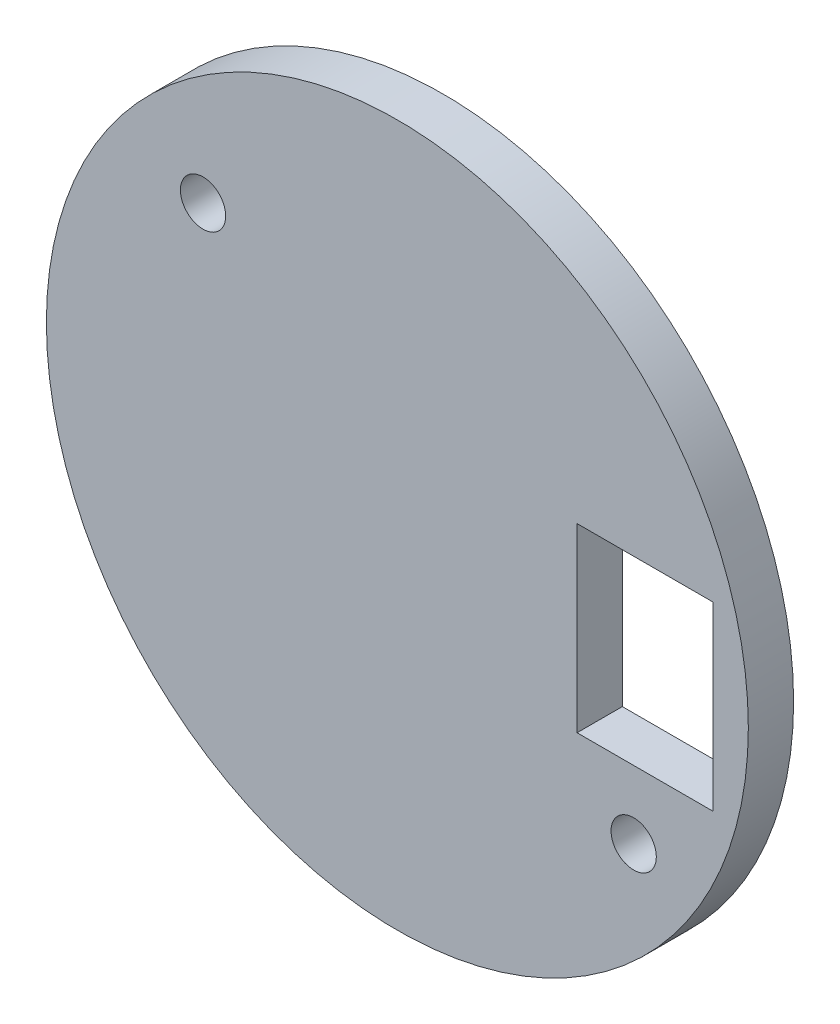
ISO-10303-21;
HEADER;
FILE_DESCRIPTION(('STEP AP214'),'2;1');
FILE_NAME('part.step','',(''),(''),'','','');
FILE_SCHEMA(('AUTOMOTIVE_DESIGN { 1 0 10303 214 1 1 1 1 }'));
ENDSEC;
DATA;
#1=APPLICATION_CONTEXT('core data for automotive mechanical design processes');
#2=APPLICATION_PROTOCOL_DEFINITION('international standard','automotive_design',2000,#1);
#3=PRODUCT_CONTEXT('',#1,'mechanical');
#4=PRODUCT('Part','Part','',(#3));
#5=PRODUCT_RELATED_PRODUCT_CATEGORY('part','',(#4));
#6=PRODUCT_DEFINITION_FORMATION('','',#4);
#7=PRODUCT_DEFINITION_CONTEXT('part definition',#1,'design');
#8=PRODUCT_DEFINITION('design','',#6,#7);
#9=PRODUCT_DEFINITION_SHAPE('','',#8);
#10=(LENGTH_UNIT() NAMED_UNIT(*) SI_UNIT(.MILLI.,.METRE.));
#11=(NAMED_UNIT(*) PLANE_ANGLE_UNIT() SI_UNIT($,.RADIAN.));
#12=(NAMED_UNIT(*) SI_UNIT($,.STERADIAN.) SOLID_ANGLE_UNIT());
#13=UNCERTAINTY_MEASURE_WITH_UNIT(LENGTH_MEASURE(1.E-05),#10,'distance_accuracy_value','');
#14=(GEOMETRIC_REPRESENTATION_CONTEXT(3) GLOBAL_UNCERTAINTY_ASSIGNED_CONTEXT((#13)) GLOBAL_UNIT_ASSIGNED_CONTEXT((#10,
#11,#12)) REPRESENTATION_CONTEXT('',''));
#15=CARTESIAN_POINT('',(0.,0.,0.));
#16=DIRECTION('',(0.,0.,1.));
#17=DIRECTION('',(1.,0.,0.));
#18=AXIS2_PLACEMENT_3D('',#15,#16,#17);
#19=CARTESIAN_POINT('',(0.,0.,2.));
#20=DIRECTION('',(0.,0.,1.));
#21=DIRECTION('',(1.,0.,0.));
#22=AXIS2_PLACEMENT_3D('',#19,#20,#21);
#23=PLANE('',#22);
#24=CARTESIAN_POINT('',(10.4359727372306,-6.97426488049745,2.));
#25=DIRECTION('',(0.,0.,1.));
#26=DIRECTION('',(1.,0.,0.));
#27=AXIS2_PLACEMENT_3D('',#24,#25,#26);
#28=CIRCLE('',#27,1.);
#29=CARTESIAN_POINT('',(11.4359727372306,-6.97426488049745,2.));
#30=VERTEX_POINT('',#29);
#31=EDGE_CURVE('E110',#30,#30,#28,.T.);
#32=ORIENTED_EDGE('',*,*,#31,.F.);
#33=EDGE_LOOP('',(#32));
#34=FACE_BOUND('',#33,.T.);
#35=CARTESIAN_POINT('',(0.,0.,2.));
#36=DIRECTION('',(0.,0.,1.));
#37=DIRECTION('',(1.,0.,0.));
#38=AXIS2_PLACEMENT_3D('',#35,#36,#37);
#39=CIRCLE('',#38,15.5);
#40=CARTESIAN_POINT('',(15.5,0.,2.));
#41=VERTEX_POINT('',#40);
#42=EDGE_CURVE('E11',#41,#41,#39,.T.);
#43=ORIENTED_EDGE('',*,*,#42,.T.);
#44=EDGE_LOOP('',(#43));
#45=FACE_BOUND('',#44,.T.);
#46=DIRECTION('',(0.,-1.,0.));
#47=VECTOR('',#46,1.);
#48=CARTESIAN_POINT('',(7.93618236952319,4.02571564197786,2.));
#49=LINE('',#48,#47);
#50=CARTESIAN_POINT('',(7.93618236952319,4.02571564197786,2.));
#51=VERTEX_POINT('',#50);
#52=CARTESIAN_POINT('',(7.93618236952319,-3.97428435802213,2.));
#53=VERTEX_POINT('',#52);
#54=EDGE_CURVE('E90',#51,#53,#49,.T.);
#55=ORIENTED_EDGE('',*,*,#54,.F.);
#56=DIRECTION('',(-1.,0.,0.));
#57=VECTOR('',#56,1.);
#58=CARTESIAN_POINT('',(13.9361823695232,4.02571564197786,2.));
#59=LINE('',#58,#57);
#60=CARTESIAN_POINT('',(13.9361823695232,4.02571564197786,2.));
#61=VERTEX_POINT('',#60);
#62=EDGE_CURVE('E82',#61,#51,#59,.T.);
#63=ORIENTED_EDGE('',*,*,#62,.F.);
#64=DIRECTION('',(0.,1.,0.));
#65=VECTOR('',#64,1.);
#66=CARTESIAN_POINT('',(13.9361823695232,4.02571564197786,2.));
#67=LINE('',#66,#65);
#68=CARTESIAN_POINT('',(13.9361823695232,-3.97428435802213,2.));
#69=VERTEX_POINT('',#68);
#70=EDGE_CURVE('E104',#69,#61,#67,.T.);
#71=ORIENTED_EDGE('',*,*,#70,.F.);
#72=DIRECTION('',(1.,0.,0.));
#73=VECTOR('',#72,1.);
#74=CARTESIAN_POINT('',(13.9361823695232,-3.97428435802213,2.));
#75=LINE('',#74,#73);
#76=EDGE_CURVE('E102',#53,#69,#75,.T.);
#77=ORIENTED_EDGE('',*,*,#76,.F.);
#78=EDGE_LOOP('',(#55,#63,#71,#77));
#79=FACE_BOUND('',#78,.T.);
#80=CARTESIAN_POINT('',(-8.58094871473817,8.02573511950256,2.));
#81=DIRECTION('',(0.,0.,1.));
#82=DIRECTION('',(1.,0.,0.));
#83=AXIS2_PLACEMENT_3D('',#80,#81,#82);
#84=CIRCLE('',#83,1.);
#85=CARTESIAN_POINT('',(-7.58094871473817,8.02573511950256,2.));
#86=VERTEX_POINT('',#85);
#87=EDGE_CURVE('E186',#86,#86,#84,.T.);
#88=ORIENTED_EDGE('',*,*,#87,.F.);
#89=EDGE_LOOP('',(#88));
#90=FACE_BOUND('',#89,.T.);
#91=ADVANCED_FACE('F41',(#34,#45,#79,#90),#23,.T.);
#92=CARTESIAN_POINT('',(0.,0.,0.));
#93=DIRECTION('',(0.,0.,1.));
#94=DIRECTION('',(1.,0.,0.));
#95=AXIS2_PLACEMENT_3D('',#92,#93,#94);
#96=PLANE('',#95);
#97=CARTESIAN_POINT('',(0.,0.,0.));
#98=DIRECTION('',(0.,0.,1.));
#99=DIRECTION('',(1.,0.,0.));
#100=AXIS2_PLACEMENT_3D('',#97,#98,#99);
#101=CIRCLE('',#100,15.5);
#102=CARTESIAN_POINT('',(15.5,0.,0.));
#103=VERTEX_POINT('',#102);
#104=EDGE_CURVE('E45',#103,#103,#101,.T.);
#105=ORIENTED_EDGE('',*,*,#104,.F.);
#106=EDGE_LOOP('',(#105));
#107=FACE_BOUND('',#106,.T.);
#108=DIRECTION('',(-1.,0.,0.));
#109=VECTOR('',#108,1.);
#110=CARTESIAN_POINT('',(13.9361823695232,4.02571564197786,0.));
#111=LINE('',#110,#109);
#112=CARTESIAN_POINT('',(13.9361823695232,4.02571564197786,0.));
#113=VERTEX_POINT('',#112);
#114=CARTESIAN_POINT('',(7.93618236952319,4.02571564197786,0.));
#115=VERTEX_POINT('',#114);
#116=EDGE_CURVE('E64',#113,#115,#111,.T.);
#117=ORIENTED_EDGE('',*,*,#116,.T.);
#118=DIRECTION('',(0.,-1.,0.));
#119=VECTOR('',#118,1.);
#120=CARTESIAN_POINT('',(7.93618236952319,4.02571564197786,0.));
#121=LINE('',#120,#119);
#122=CARTESIAN_POINT('',(7.93618236952319,-3.97428435802213,0.));
#123=VERTEX_POINT('',#122);
#124=EDGE_CURVE('E97',#115,#123,#121,.T.);
#125=ORIENTED_EDGE('',*,*,#124,.T.);
#126=DIRECTION('',(1.,0.,0.));
#127=VECTOR('',#126,1.);
#128=CARTESIAN_POINT('',(13.9361823695232,-3.97428435802213,0.));
#129=LINE('',#128,#127);
#130=CARTESIAN_POINT('',(13.9361823695232,-3.97428435802213,0.));
#131=VERTEX_POINT('',#130);
#132=EDGE_CURVE('E112',#123,#131,#129,.T.);
#133=ORIENTED_EDGE('',*,*,#132,.T.);
#134=DIRECTION('',(0.,1.,0.));
#135=VECTOR('',#134,1.);
#136=CARTESIAN_POINT('',(13.9361823695232,4.02571564197786,0.));
#137=LINE('',#136,#135);
#138=EDGE_CURVE('E91',#131,#113,#137,.T.);
#139=ORIENTED_EDGE('',*,*,#138,.T.);
#140=EDGE_LOOP('',(#117,#125,#133,#139));
#141=FACE_BOUND('',#140,.T.);
#142=CARTESIAN_POINT('',(10.4359727372306,-6.97426488049745,0.));
#143=DIRECTION('',(0.,0.,1.));
#144=DIRECTION('',(1.,0.,0.));
#145=AXIS2_PLACEMENT_3D('',#142,#143,#144);
#146=CIRCLE('',#145,1.);
#147=CARTESIAN_POINT('',(11.4359727372306,-6.97426488049745,0.));
#148=VERTEX_POINT('',#147);
#149=EDGE_CURVE('E192',#148,#148,#146,.T.);
#150=ORIENTED_EDGE('',*,*,#149,.T.);
#151=EDGE_LOOP('',(#150));
#152=FACE_BOUND('',#151,.T.);
#153=CARTESIAN_POINT('',(-8.58094871473817,8.02573511950256,0.));
#154=DIRECTION('',(0.,0.,1.));
#155=DIRECTION('',(1.,0.,0.));
#156=AXIS2_PLACEMENT_3D('',#153,#154,#155);
#157=CIRCLE('',#156,1.);
#158=CARTESIAN_POINT('',(-7.58094871473817,8.02573511950256,0.));
#159=VERTEX_POINT('',#158);
#160=EDGE_CURVE('E189',#159,#159,#157,.T.);
#161=ORIENTED_EDGE('',*,*,#160,.T.);
#162=EDGE_LOOP('',(#161));
#163=FACE_BOUND('',#162,.T.);
#164=ADVANCED_FACE('F123',(#107,#141,#152,#163),#96,.F.);
#165=CARTESIAN_POINT('',(0.,0.,2.));
#166=DIRECTION('',(0.,0.,-1.));
#167=DIRECTION('',(-1.,0.,0.));
#168=AXIS2_PLACEMENT_3D('',#165,#166,#167);
#169=CYLINDRICAL_SURFACE('',#168,15.5);
#170=ORIENTED_EDGE('',*,*,#42,.F.);
#171=EDGE_LOOP('',(#170));
#172=FACE_BOUND('',#171,.T.);
#173=ORIENTED_EDGE('',*,*,#104,.T.);
#174=EDGE_LOOP('',(#173));
#175=FACE_BOUND('',#174,.T.);
#176=ADVANCED_FACE('F43',(#172,#175),#169,.T.);
#177=CARTESIAN_POINT('',(13.9361823695232,4.02571564197786,2.));
#178=DIRECTION('',(0.,-1.,0.));
#179=DIRECTION('',(1.,0.,0.));
#180=AXIS2_PLACEMENT_3D('',#177,#178,#179);
#181=PLANE('',#180);
#182=ORIENTED_EDGE('',*,*,#116,.F.);
#183=DIRECTION('',(0.,0.,-1.));
#184=VECTOR('',#183,1.);
#185=CARTESIAN_POINT('',(13.9361823695232,4.02571564197786,2.));
#186=LINE('',#185,#184);
#187=EDGE_CURVE('E86',#61,#113,#186,.T.);
#188=ORIENTED_EDGE('',*,*,#187,.F.);
#189=ORIENTED_EDGE('',*,*,#62,.T.);
#190=DIRECTION('',(0.,0.,-1.));
#191=VECTOR('',#190,1.);
#192=CARTESIAN_POINT('',(7.93618236952319,4.02571564197786,2.));
#193=LINE('',#192,#191);
#194=EDGE_CURVE('E85',#51,#115,#193,.T.);
#195=ORIENTED_EDGE('',*,*,#194,.T.);
#196=EDGE_LOOP('',(#182,#188,#189,#195));
#197=FACE_BOUND('',#196,.T.);
#198=ADVANCED_FACE('F84',(#197),#181,.T.);
#199=CARTESIAN_POINT('',(7.93618236952319,4.02571564197786,2.));
#200=DIRECTION('',(1.,0.,0.));
#201=DIRECTION('',(0.,0.,-1.));
#202=AXIS2_PLACEMENT_3D('',#199,#200,#201);
#203=PLANE('',#202);
#204=ORIENTED_EDGE('',*,*,#124,.F.);
#205=ORIENTED_EDGE('',*,*,#194,.F.);
#206=ORIENTED_EDGE('',*,*,#54,.T.);
#207=DIRECTION('',(0.,0.,-1.));
#208=VECTOR('',#207,1.);
#209=CARTESIAN_POINT('',(7.93618236952319,-3.97428435802213,2.));
#210=LINE('',#209,#208);
#211=EDGE_CURVE('E98',#53,#123,#210,.T.);
#212=ORIENTED_EDGE('',*,*,#211,.T.);
#213=EDGE_LOOP('',(#204,#205,#206,#212));
#214=FACE_BOUND('',#213,.T.);
#215=ADVANCED_FACE('F94',(#214),#203,.T.);
#216=CARTESIAN_POINT('',(13.9361823695232,-3.97428435802213,2.));
#217=DIRECTION('',(0.,1.,0.));
#218=DIRECTION('',(0.,0.,1.));
#219=AXIS2_PLACEMENT_3D('',#216,#217,#218);
#220=PLANE('',#219);
#221=ORIENTED_EDGE('',*,*,#132,.F.);
#222=ORIENTED_EDGE('',*,*,#211,.F.);
#223=ORIENTED_EDGE('',*,*,#76,.T.);
#224=DIRECTION('',(0.,0.,-1.));
#225=VECTOR('',#224,1.);
#226=CARTESIAN_POINT('',(13.9361823695232,-3.97428435802213,2.));
#227=LINE('',#226,#225);
#228=EDGE_CURVE('E56',#69,#131,#227,.T.);
#229=ORIENTED_EDGE('',*,*,#228,.T.);
#230=EDGE_LOOP('',(#221,#222,#223,#229));
#231=FACE_BOUND('',#230,.T.);
#232=ADVANCED_FACE('F121',(#231),#220,.T.);
#233=CARTESIAN_POINT('',(13.9361823695232,4.02571564197786,2.));
#234=DIRECTION('',(-1.,0.,0.));
#235=DIRECTION('',(0.,0.,1.));
#236=AXIS2_PLACEMENT_3D('',#233,#234,#235);
#237=PLANE('',#236);
#238=ORIENTED_EDGE('',*,*,#138,.F.);
#239=ORIENTED_EDGE('',*,*,#228,.F.);
#240=ORIENTED_EDGE('',*,*,#70,.T.);
#241=ORIENTED_EDGE('',*,*,#187,.T.);
#242=EDGE_LOOP('',(#238,#239,#240,#241));
#243=FACE_BOUND('',#242,.T.);
#244=ADVANCED_FACE('F125',(#243),#237,.T.);
#245=CARTESIAN_POINT('',(10.4359727372306,-6.97426488049745,2.));
#246=DIRECTION('',(0.,0.,-1.));
#247=DIRECTION('',(-1.,0.,0.));
#248=AXIS2_PLACEMENT_3D('',#245,#246,#247);
#249=CYLINDRICAL_SURFACE('',#248,1.);
#250=ORIENTED_EDGE('',*,*,#31,.T.);
#251=EDGE_LOOP('',(#250));
#252=FACE_BOUND('',#251,.T.);
#253=ORIENTED_EDGE('',*,*,#149,.F.);
#254=EDGE_LOOP('',(#253));
#255=FACE_BOUND('',#254,.T.);
#256=ADVANCED_FACE('F127',(#252,#255),#249,.F.);
#257=CARTESIAN_POINT('',(-8.58094871473817,8.02573511950256,2.));
#258=DIRECTION('',(0.,0.,-1.));
#259=DIRECTION('',(-1.,0.,0.));
#260=AXIS2_PLACEMENT_3D('',#257,#258,#259);
#261=CYLINDRICAL_SURFACE('',#260,1.);
#262=ORIENTED_EDGE('',*,*,#87,.T.);
#263=EDGE_LOOP('',(#262));
#264=FACE_BOUND('',#263,.T.);
#265=ORIENTED_EDGE('',*,*,#160,.F.);
#266=EDGE_LOOP('',(#265));
#267=FACE_BOUND('',#266,.T.);
#268=ADVANCED_FACE('F133',(#264,#267),#261,.F.);
#269=CLOSED_SHELL('',(#91,#164,#176,#198,#215,#232,#244,#256,#268));
#270=MANIFOLD_SOLID_BREP('B2',#269);
#271=ADVANCED_BREP_SHAPE_REPRESENTATION('',(#18,#270),#14);
#272=SHAPE_DEFINITION_REPRESENTATION(#9,#271);
ENDSEC;
END-ISO-10303-21;
